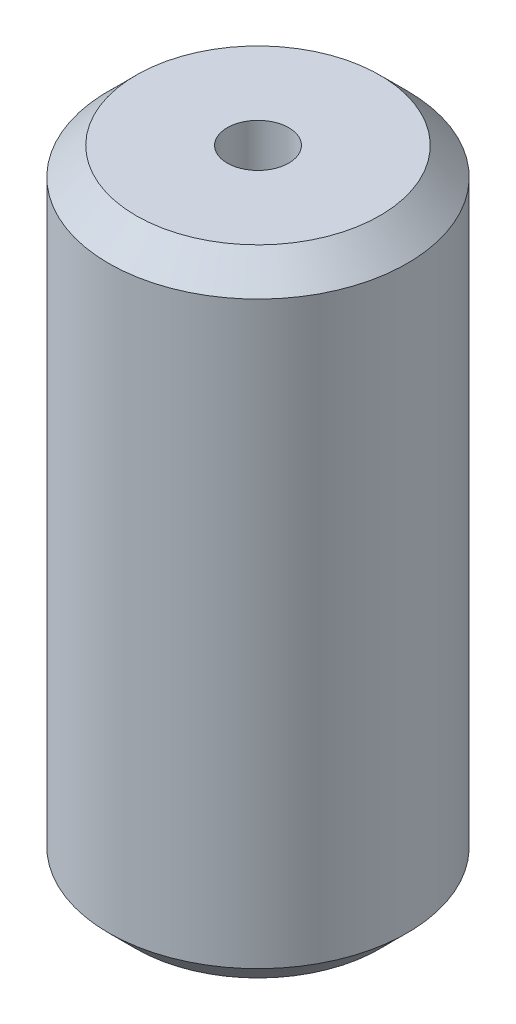
ISO-10303-21;
HEADER;
FILE_DESCRIPTION(('STEP AP214'),'2;1');
FILE_NAME('part.step','',(''),(''),'','','');
FILE_SCHEMA(('AUTOMOTIVE_DESIGN { 1 0 10303 214 1 1 1 1 }'));
ENDSEC;
DATA;
#1=APPLICATION_CONTEXT('core data for automotive mechanical design processes');
#2=APPLICATION_PROTOCOL_DEFINITION('international standard','automotive_design',2000,#1);
#3=PRODUCT_CONTEXT('',#1,'mechanical');
#4=PRODUCT('Part','Part','',(#3));
#5=PRODUCT_RELATED_PRODUCT_CATEGORY('part','',(#4));
#6=PRODUCT_DEFINITION_FORMATION('','',#4);
#7=PRODUCT_DEFINITION_CONTEXT('part definition',#1,'design');
#8=PRODUCT_DEFINITION('design','',#6,#7);
#9=PRODUCT_DEFINITION_SHAPE('','',#8);
#10=(LENGTH_UNIT() NAMED_UNIT(*) SI_UNIT(.MILLI.,.METRE.));
#11=(NAMED_UNIT(*) PLANE_ANGLE_UNIT() SI_UNIT($,.RADIAN.));
#12=(NAMED_UNIT(*) SI_UNIT($,.STERADIAN.) SOLID_ANGLE_UNIT());
#13=UNCERTAINTY_MEASURE_WITH_UNIT(LENGTH_MEASURE(1.E-05),#10,'distance_accuracy_value','');
#14=(GEOMETRIC_REPRESENTATION_CONTEXT(3) GLOBAL_UNCERTAINTY_ASSIGNED_CONTEXT((#13)) GLOBAL_UNIT_ASSIGNED_CONTEXT((#10,
#11,#12)) REPRESENTATION_CONTEXT('',''));
#15=CARTESIAN_POINT('',(0.,0.,0.));
#16=DIRECTION('',(0.,0.,1.));
#17=DIRECTION('',(1.,0.,0.));
#18=AXIS2_PLACEMENT_3D('',#15,#16,#17);
#19=CARTESIAN_POINT('',(0.,21.2566239500021,0.));
#20=DIRECTION('',(0.,-1.,0.));
#21=DIRECTION('',(0.,0.,-1.));
#22=AXIS2_PLACEMENT_3D('',#19,#20,#21);
#23=CYLINDRICAL_SURFACE('',#22,5.);
#24=CARTESIAN_POINT('',(0.,20.3352847176401,0.));
#25=DIRECTION('',(0.,1.,0.));
#26=DIRECTION('',(0.,0.,1.));
#27=AXIS2_PLACEMENT_3D('',#24,#25,#26);
#28=CIRCLE('',#27,5.);
#29=CARTESIAN_POINT('',(0.,20.3352847176401,5.));
#30=VERTEX_POINT('',#29);
#31=EDGE_CURVE('E50',#30,#30,#28,.F.);
#32=ORIENTED_EDGE('',*,*,#31,.T.);
#33=EDGE_LOOP('',(#32));
#34=FACE_BOUND('',#33,.T.);
#35=CARTESIAN_POINT('',(0.,0.921339232361974,0.));
#36=DIRECTION('',(0.,1.,0.));
#37=DIRECTION('',(0.,0.,1.));
#38=AXIS2_PLACEMENT_3D('',#35,#36,#37);
#39=CIRCLE('',#38,5.);
#40=CARTESIAN_POINT('',(0.,0.921339232361974,5.));
#41=VERTEX_POINT('',#40);
#42=EDGE_CURVE('E51',#41,#41,#39,.T.);
#43=ORIENTED_EDGE('',*,*,#42,.T.);
#44=EDGE_LOOP('',(#43));
#45=FACE_BOUND('',#44,.T.);
#46=ADVANCED_FACE('F39',(#34,#45),#23,.T.);
#47=CARTESIAN_POINT('',(0.,21.2566239500021,0.));
#48=DIRECTION('',(0.,1.,0.));
#49=DIRECTION('',(0.,0.,1.));
#50=AXIS2_PLACEMENT_3D('',#47,#48,#49);
#51=PLANE('',#50);
#52=CARTESIAN_POINT('',(0.,21.2566239500021,0.));
#53=DIRECTION('',(0.,1.,0.));
#54=DIRECTION('',(0.,0.,1.));
#55=AXIS2_PLACEMENT_3D('',#52,#53,#54);
#56=CIRCLE('',#55,4.07866076763803);
#57=CARTESIAN_POINT('',(0.,21.2566239500021,4.07866076763803));
#58=VERTEX_POINT('',#57);
#59=EDGE_CURVE('E54',#58,#58,#56,.T.);
#60=ORIENTED_EDGE('',*,*,#59,.T.);
#61=EDGE_LOOP('',(#60));
#62=FACE_BOUND('',#61,.T.);
#63=CARTESIAN_POINT('',(0.,21.2566239500021,0.));
#64=DIRECTION('',(0.,1.,0.));
#65=DIRECTION('',(0.,0.,1.));
#66=AXIS2_PLACEMENT_3D('',#63,#64,#65);
#67=CIRCLE('',#66,1.0291427937679);
#68=CARTESIAN_POINT('',(0.,21.2566239500021,1.0291427937679));
#69=VERTEX_POINT('',#68);
#70=EDGE_CURVE('E58',#69,#69,#67,.T.);
#71=ORIENTED_EDGE('',*,*,#70,.F.);
#72=EDGE_LOOP('',(#71));
#73=FACE_BOUND('',#72,.T.);
#74=ADVANCED_FACE('F69',(#62,#73),#51,.T.);
#75=CARTESIAN_POINT('',(0.,0.,0.));
#76=DIRECTION('',(0.,1.,0.));
#77=DIRECTION('',(0.,0.,1.));
#78=AXIS2_PLACEMENT_3D('',#75,#76,#77);
#79=PLANE('',#78);
#80=CARTESIAN_POINT('',(0.,0.,0.));
#81=DIRECTION('',(0.,1.,0.));
#82=DIRECTION('',(0.,0.,1.));
#83=AXIS2_PLACEMENT_3D('',#80,#81,#82);
#84=CIRCLE('',#83,4.07866076763802);
#85=CARTESIAN_POINT('',(0.,0.,4.07866076763802));
#86=VERTEX_POINT('',#85);
#87=EDGE_CURVE('E10',#86,#86,#84,.F.);
#88=ORIENTED_EDGE('',*,*,#87,.T.);
#89=EDGE_LOOP('',(#88));
#90=FACE_BOUND('',#89,.T.);
#91=CARTESIAN_POINT('',(0.,0.,0.));
#92=DIRECTION('',(0.,1.,0.));
#93=DIRECTION('',(0.,0.,1.));
#94=AXIS2_PLACEMENT_3D('',#91,#92,#93);
#95=CIRCLE('',#94,1.0291427937679);
#96=CARTESIAN_POINT('',(0.,0.,1.0291427937679));
#97=VERTEX_POINT('',#96);
#98=EDGE_CURVE('E63',#97,#97,#95,.T.);
#99=ORIENTED_EDGE('',*,*,#98,.T.);
#100=EDGE_LOOP('',(#99));
#101=FACE_BOUND('',#100,.T.);
#102=ADVANCED_FACE('F75',(#90,#101),#79,.F.);
#103=CARTESIAN_POINT('',(0.,21.2566239500021,0.));
#104=DIRECTION('',(0.,-1.,0.));
#105=DIRECTION('',(0.,0.,-1.));
#106=AXIS2_PLACEMENT_3D('',#103,#104,#105);
#107=CYLINDRICAL_SURFACE('',#106,1.0291427937679);
#108=ORIENTED_EDGE('',*,*,#70,.T.);
#109=EDGE_LOOP('',(#108));
#110=FACE_BOUND('',#109,.T.);
#111=ORIENTED_EDGE('',*,*,#98,.F.);
#112=EDGE_LOOP('',(#111));
#113=FACE_BOUND('',#112,.T.);
#114=ADVANCED_FACE('F70',(#110,#113),#107,.F.);
#115=CARTESIAN_POINT('',(0.,21.2566239500021,0.));
#116=DIRECTION('',(0.,-1.,0.));
#117=DIRECTION('',(0.,0.,-1.));
#118=AXIS2_PLACEMENT_3D('',#115,#116,#117);
#119=CONICAL_SURFACE('',#118,4.07866076763803,0.785398163397444);
#120=ORIENTED_EDGE('',*,*,#31,.F.);
#121=EDGE_LOOP('',(#120));
#122=FACE_BOUND('',#121,.T.);
#123=ORIENTED_EDGE('',*,*,#59,.F.);
#124=EDGE_LOOP('',(#123));
#125=FACE_BOUND('',#124,.T.);
#126=ADVANCED_FACE('F81',(#122,#125),#119,.T.);
#127=CARTESIAN_POINT('',(0.,0.921339232361974,0.));
#128=DIRECTION('',(0.,1.,0.));
#129=DIRECTION('',(0.,0.,1.));
#130=AXIS2_PLACEMENT_3D('',#127,#128,#129);
#131=CONICAL_SURFACE('',#130,5.,0.785398163397452);
#132=ORIENTED_EDGE('',*,*,#87,.F.);
#133=EDGE_LOOP('',(#132));
#134=FACE_BOUND('',#133,.T.);
#135=ORIENTED_EDGE('',*,*,#42,.F.);
#136=EDGE_LOOP('',(#135));
#137=FACE_BOUND('',#136,.T.);
#138=ADVANCED_FACE('F45',(#134,#137),#131,.T.);
#139=CLOSED_SHELL('',(#46,#74,#102,#114,#126,#138));
#140=MANIFOLD_SOLID_BREP('B2',#139);
#141=ADVANCED_BREP_SHAPE_REPRESENTATION('',(#18,#140),#14);
#142=SHAPE_DEFINITION_REPRESENTATION(#9,#141);
ENDSEC;
END-ISO-10303-21;
